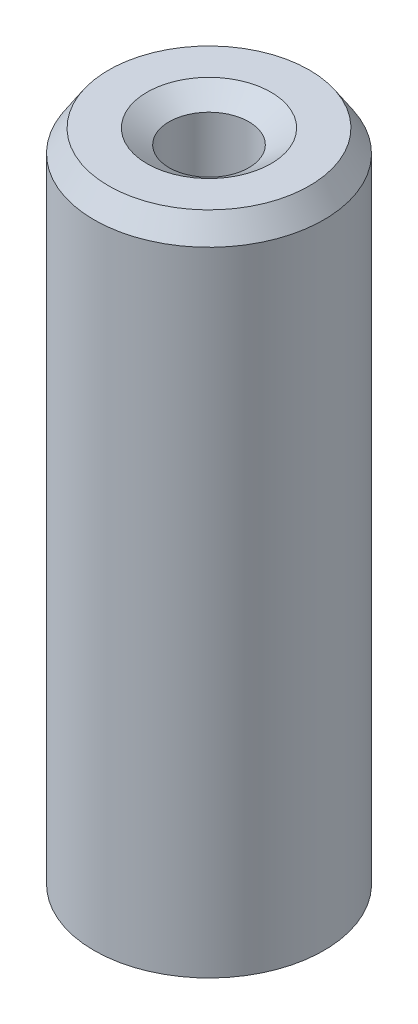
ISO-10303-21;
HEADER;
FILE_DESCRIPTION(('STEP AP214'),'2;1');
FILE_NAME('part.step','',(''),(''),'','','');
FILE_SCHEMA(('AUTOMOTIVE_DESIGN { 1 0 10303 214 1 1 1 1 }'));
ENDSEC;
DATA;
#1=APPLICATION_CONTEXT('core data for automotive mechanical design processes');
#2=APPLICATION_PROTOCOL_DEFINITION('international standard','automotive_design',2000,#1);
#3=PRODUCT_CONTEXT('',#1,'mechanical');
#4=PRODUCT('Part','Part','',(#3));
#5=PRODUCT_RELATED_PRODUCT_CATEGORY('part','',(#4));
#6=PRODUCT_DEFINITION_FORMATION('','',#4);
#7=PRODUCT_DEFINITION_CONTEXT('part definition',#1,'design');
#8=PRODUCT_DEFINITION('design','',#6,#7);
#9=PRODUCT_DEFINITION_SHAPE('','',#8);
#10=(LENGTH_UNIT() NAMED_UNIT(*) SI_UNIT(.MILLI.,.METRE.));
#11=(NAMED_UNIT(*) PLANE_ANGLE_UNIT() SI_UNIT($,.RADIAN.));
#12=(NAMED_UNIT(*) SI_UNIT($,.STERADIAN.) SOLID_ANGLE_UNIT());
#13=UNCERTAINTY_MEASURE_WITH_UNIT(LENGTH_MEASURE(1.E-05),#10,'distance_accuracy_value','');
#14=(GEOMETRIC_REPRESENTATION_CONTEXT(3) GLOBAL_UNCERTAINTY_ASSIGNED_CONTEXT((#13)) GLOBAL_UNIT_ASSIGNED_CONTEXT((#10,
#11,#12)) REPRESENTATION_CONTEXT('',''));
#15=CARTESIAN_POINT('',(0.,0.,0.));
#16=DIRECTION('',(0.,0.,1.));
#17=DIRECTION('',(1.,0.,0.));
#18=AXIS2_PLACEMENT_3D('',#15,#16,#17);
#19=CARTESIAN_POINT('',(0.,87.3805619290732,0.));
#20=DIRECTION('',(0.,-1.,0.));
#21=DIRECTION('',(0.,0.,-1.));
#22=AXIS2_PLACEMENT_3D('',#19,#20,#21);
#23=CYLINDRICAL_SURFACE('',#22,15.);
#24=CARTESIAN_POINT('',(0.,1.89704975625297,0.));
#25=DIRECTION('',(0.,1.,0.));
#26=DIRECTION('',(0.,0.,1.));
#27=AXIS2_PLACEMENT_3D('',#24,#25,#26);
#28=CIRCLE('',#27,15.);
#29=CARTESIAN_POINT('',(0.,1.89704975625297,15.));
#30=VERTEX_POINT('',#29);
#31=EDGE_CURVE('E10',#30,#30,#28,.T.);
#32=ORIENTED_EDGE('',*,*,#31,.T.);
#33=EDGE_LOOP('',(#32));
#34=FACE_BOUND('',#33,.T.);
#35=CARTESIAN_POINT('',(0.,84.4921304916839,0.));
#36=DIRECTION('',(0.,1.,0.));
#37=DIRECTION('',(0.,0.,1.));
#38=AXIS2_PLACEMENT_3D('',#35,#36,#37);
#39=CIRCLE('',#38,15.);
#40=CARTESIAN_POINT('',(0.,84.4921304916839,15.));
#41=VERTEX_POINT('',#40);
#42=EDGE_CURVE('E50',#41,#41,#39,.F.);
#43=ORIENTED_EDGE('',*,*,#42,.T.);
#44=EDGE_LOOP('',(#43));
#45=FACE_BOUND('',#44,.T.);
#46=ADVANCED_FACE('F39',(#34,#45),#23,.T.);
#47=CARTESIAN_POINT('',(0.,87.3805619290732,0.));
#48=DIRECTION('',(0.,1.,0.));
#49=DIRECTION('',(0.,0.,1.));
#50=AXIS2_PLACEMENT_3D('',#47,#48,#49);
#51=PLANE('',#50);
#52=CARTESIAN_POINT('',(0.,87.3805619290732,0.));
#53=DIRECTION('',(0.,1.,0.));
#54=DIRECTION('',(0.,0.,1.));
#55=AXIS2_PLACEMENT_3D('',#52,#53,#54);
#56=CIRCLE('',#55,8.09088606203556);
#57=CARTESIAN_POINT('',(0.,87.3805619290732,8.09088606203556));
#58=VERTEX_POINT('',#57);
#59=EDGE_CURVE('E58',#58,#58,#56,.F.);
#60=ORIENTED_EDGE('',*,*,#59,.T.);
#61=EDGE_LOOP('',(#60));
#62=FACE_BOUND('',#61,.T.);
#63=CARTESIAN_POINT('',(0.,87.3805619290732,0.));
#64=DIRECTION('',(0.,1.,0.));
#65=DIRECTION('',(0.,0.,1.));
#66=AXIS2_PLACEMENT_3D('',#63,#64,#65);
#67=CIRCLE('',#66,13.102950243747);
#68=CARTESIAN_POINT('',(0.,87.3805619290732,13.102950243747));
#69=VERTEX_POINT('',#68);
#70=EDGE_CURVE('E61',#69,#69,#67,.T.);
#71=ORIENTED_EDGE('',*,*,#70,.T.);
#72=EDGE_LOOP('',(#71));
#73=FACE_BOUND('',#72,.T.);
#74=ADVANCED_FACE('F88',(#62,#73),#51,.T.);
#75=CARTESIAN_POINT('',(0.,0.,0.));
#76=DIRECTION('',(0.,1.,0.));
#77=DIRECTION('',(0.,0.,1.));
#78=AXIS2_PLACEMENT_3D('',#75,#76,#77);
#79=PLANE('',#78);
#80=CARTESIAN_POINT('',(0.,0.,0.));
#81=DIRECTION('',(0.,1.,0.));
#82=DIRECTION('',(0.,0.,1.));
#83=AXIS2_PLACEMENT_3D('',#80,#81,#82);
#84=CIRCLE('',#83,7.09950438089922);
#85=CARTESIAN_POINT('',(0.,0.,7.09950438089922));
#86=VERTEX_POINT('',#85);
#87=EDGE_CURVE('E51',#86,#86,#84,.T.);
#88=ORIENTED_EDGE('',*,*,#87,.T.);
#89=EDGE_LOOP('',(#88));
#90=FACE_BOUND('',#89,.T.);
#91=CARTESIAN_POINT('',(0.,0.,0.));
#92=DIRECTION('',(0.,1.,0.));
#93=DIRECTION('',(0.,0.,1.));
#94=AXIS2_PLACEMENT_3D('',#91,#92,#93);
#95=CIRCLE('',#94,12.1115685626107);
#96=CARTESIAN_POINT('',(0.,0.,12.1115685626107));
#97=VERTEX_POINT('',#96);
#98=EDGE_CURVE('E54',#97,#97,#95,.F.);
#99=ORIENTED_EDGE('',*,*,#98,.T.);
#100=EDGE_LOOP('',(#99));
#101=FACE_BOUND('',#100,.T.);
#102=ADVANCED_FACE('F83',(#90,#101),#79,.F.);
#103=CARTESIAN_POINT('',(0.,87.3805619290732,0.));
#104=DIRECTION('',(0.,-1.,0.));
#105=DIRECTION('',(0.,0.,-1.));
#106=AXIS2_PLACEMENT_3D('',#103,#104,#105);
#107=CYLINDRICAL_SURFACE('',#106,5.20245462464623);
#108=CARTESIAN_POINT('',(0.,85.4835121728201,0.));
#109=DIRECTION('',(0.,1.,0.));
#110=DIRECTION('',(0.,0.,1.));
#111=AXIS2_PLACEMENT_3D('',#108,#109,#110);
#112=CIRCLE('',#111,5.20245462464623);
#113=CARTESIAN_POINT('',(0.,85.4835121728201,5.20245462464623));
#114=VERTEX_POINT('',#113);
#115=EDGE_CURVE('E67',#114,#114,#112,.T.);
#116=ORIENTED_EDGE('',*,*,#115,.T.);
#117=EDGE_LOOP('',(#116));
#118=FACE_BOUND('',#117,.T.);
#119=CARTESIAN_POINT('',(0.,2.88843143738929,0.));
#120=DIRECTION('',(0.,1.,0.));
#121=DIRECTION('',(0.,0.,1.));
#122=AXIS2_PLACEMENT_3D('',#119,#120,#121);
#123=CIRCLE('',#122,5.20245462464623);
#124=CARTESIAN_POINT('',(0.,2.88843143738929,5.20245462464623));
#125=VERTEX_POINT('',#124);
#126=EDGE_CURVE('E69',#125,#125,#123,.F.);
#127=ORIENTED_EDGE('',*,*,#126,.T.);
#128=EDGE_LOOP('',(#127));
#129=FACE_BOUND('',#128,.T.);
#130=ADVANCED_FACE('F71',(#118,#129),#107,.F.);
#131=CARTESIAN_POINT('',(0.,85.4835121728201,0.));
#132=DIRECTION('',(0.,1.,0.));
#133=DIRECTION('',(0.,0.,1.));
#134=AXIS2_PLACEMENT_3D('',#131,#132,#133);
#135=CONICAL_SURFACE('',#134,5.20245462464623,0.989673051012792);
#136=ORIENTED_EDGE('',*,*,#59,.F.);
#137=EDGE_LOOP('',(#136));
#138=FACE_BOUND('',#137,.T.);
#139=ORIENTED_EDGE('',*,*,#115,.F.);
#140=EDGE_LOOP('',(#139));
#141=FACE_BOUND('',#140,.T.);
#142=ADVANCED_FACE('F77',(#138,#141),#135,.F.);
#143=CARTESIAN_POINT('',(0.,0.,0.));
#144=DIRECTION('',(0.,-1.,0.));
#145=DIRECTION('',(0.,0.,-1.));
#146=AXIS2_PLACEMENT_3D('',#143,#144,#145);
#147=CONICAL_SURFACE('',#146,7.09950438089922,0.581123275782106);
#148=ORIENTED_EDGE('',*,*,#126,.F.);
#149=EDGE_LOOP('',(#148));
#150=FACE_BOUND('',#149,.T.);
#151=ORIENTED_EDGE('',*,*,#87,.F.);
#152=EDGE_LOOP('',(#151));
#153=FACE_BOUND('',#152,.T.);
#154=ADVANCED_FACE('F73',(#150,#153),#147,.F.);
#155=CARTESIAN_POINT('',(0.,1.89704975625297,0.));
#156=DIRECTION('',(0.,1.,0.));
#157=DIRECTION('',(0.,0.,1.));
#158=AXIS2_PLACEMENT_3D('',#155,#156,#157);
#159=CONICAL_SURFACE('',#158,15.,0.989673051012794);
#160=CARTESIAN_POINT('',(0.,0.,12.1115685626107));
#161=CARTESIAN_POINT('',(0.,0.0197609349609687,12.1416563900835));
#162=CARTESIAN_POINT('',(0.,0.039521869921937,12.1717442175563));
#163=CARTESIAN_POINT('',(0.,0.0790437398438737,12.2319198725019));
#164=CARTESIAN_POINT('',(0.,0.098804674804842,12.2620076999747));
#165=CARTESIAN_POINT('',(0.,0.138326544726779,12.3221833549203));
#166=CARTESIAN_POINT('',(0.,0.158087479687748,12.3522711823932));
#167=CARTESIAN_POINT('',(0.,0.197609349609685,12.4124468373388));
#168=CARTESIAN_POINT('',(0.,0.217370284570653,12.4425346648116));
#169=CARTESIAN_POINT('',(0.,0.25689215449259,12.5027103197572));
#170=CARTESIAN_POINT('',(0.,0.276653089453559,12.53279814723));
#171=CARTESIAN_POINT('',(0.,0.316174959375496,12.5929738021756));
#172=CARTESIAN_POINT('',(0.,0.335935894336464,12.6230616296484));
#173=CARTESIAN_POINT('',(0.,0.375457764258401,12.683237284594));
#174=CARTESIAN_POINT('',(0.,0.395218699219369,12.7133251120668));
#175=CARTESIAN_POINT('',(0.,0.434740569141307,12.7735007670124));
#176=CARTESIAN_POINT('',(0.,0.454501504102275,12.8035885944852));
#177=CARTESIAN_POINT('',(0.,0.494023374024212,12.8637642494308));
#178=CARTESIAN_POINT('',(0.,0.513784308985181,12.8938520769036));
#179=CARTESIAN_POINT('',(0.,0.553306178907117,12.9540277318493));
#180=CARTESIAN_POINT('',(0.,0.573067113868086,12.9841155593221));
#181=CARTESIAN_POINT('',(0.,0.612588983790023,13.0442912142677));
#182=CARTESIAN_POINT('',(0.,0.632349918750991,13.0743790417405));
#183=CARTESIAN_POINT('',(0.,0.671871788672929,13.1345546966861));
#184=CARTESIAN_POINT('',(0.,0.691632723633897,13.1646425241589));
#185=CARTESIAN_POINT('',(0.,0.731154593555834,13.2248181791045));
#186=CARTESIAN_POINT('',(0.,0.750915528516802,13.2549060065773));
#187=CARTESIAN_POINT('',(0.,0.790437398438739,13.3150816615229));
#188=CARTESIAN_POINT('',(0.,0.810198333399708,13.3451694889957));
#189=CARTESIAN_POINT('',(0.,0.849720203321645,13.4053451439413));
#190=CARTESIAN_POINT('',(0.,0.869481138282613,13.4354329714141));
#191=CARTESIAN_POINT('',(0.,0.90900300820455,13.4956086263597));
#192=CARTESIAN_POINT('',(0.,0.928763943165519,13.5256964538326));
#193=CARTESIAN_POINT('',(0.,0.968285813087456,13.5858721087782));
#194=CARTESIAN_POINT('',(0.,0.988046748048424,13.615959936251));
#195=CARTESIAN_POINT('',(0.,1.02756861797036,13.6761355911966));
#196=CARTESIAN_POINT('',(0.,1.04732955293133,13.7062234186694));
#197=CARTESIAN_POINT('',(0.,1.08685142285327,13.766399073615));
#198=CARTESIAN_POINT('',(0.,1.10661235781424,13.7964869010878));
#199=CARTESIAN_POINT('',(0.,1.14613422773617,13.8566625560334));
#200=CARTESIAN_POINT('',(0.,1.16589516269714,13.8867503835062));
#201=CARTESIAN_POINT('',(0.,1.20541703261908,13.9469260384518));
#202=CARTESIAN_POINT('',(0.,1.22517796758005,13.9770138659246));
#203=CARTESIAN_POINT('',(0.,1.26469983750198,14.0371895208702));
#204=CARTESIAN_POINT('',(0.,1.28446077246295,14.067277348343));
#205=CARTESIAN_POINT('',(0.,1.32398264238489,14.1274530032887));
#206=CARTESIAN_POINT('',(0.,1.34374357734586,14.1575408307615));
#207=CARTESIAN_POINT('',(0.,1.38326544726779,14.2177164857071));
#208=CARTESIAN_POINT('',(0.,1.40302638222876,14.2478043131799));
#209=CARTESIAN_POINT('',(0.,1.4425482521507,14.3079799681255));
#210=CARTESIAN_POINT('',(0.,1.46230918711167,14.3380677955983));
#211=CARTESIAN_POINT('',(0.,1.5018310570336,14.3982434505439));
#212=CARTESIAN_POINT('',(0.,1.52159199199457,14.4283312780167));
#213=CARTESIAN_POINT('',(0.,1.56111386191651,14.4885069329623));
#214=CARTESIAN_POINT('',(0.,1.58087479687748,14.5185947604351));
#215=CARTESIAN_POINT('',(0.,1.62039666679942,14.5787704153807));
#216=CARTESIAN_POINT('',(0.,1.64015760176038,14.6088582428535));
#217=CARTESIAN_POINT('',(0.,1.67967947168232,14.6690338977991));
#218=CARTESIAN_POINT('',(0.,1.69944040664329,14.6991217252719));
#219=CARTESIAN_POINT('',(0.,1.73896227656523,14.7592973802176));
#220=CARTESIAN_POINT('',(0.,1.7587232115262,14.7893852076904));
#221=CARTESIAN_POINT('',(0.,1.79824508144813,14.849560862636));
#222=CARTESIAN_POINT('',(0.,1.8180060164091,14.8796486901088));
#223=CARTESIAN_POINT('',(0.,1.85752788633104,14.9398243450544));
#224=CARTESIAN_POINT('',(0.,1.87728882129201,14.9699121725272));
#225=CARTESIAN_POINT('',(0.,1.89704975625297,15.));
#226=B_SPLINE_CURVE_WITH_KNOTS('',3,(#160,#161,#162,#163,#164,#165,#166,#167,#168,#169,#170,
#171,#172,#173,#174,#175,#176,#177,#178,#179,#180,#181,#182,#183,#184,#185,#186,#187,#188,#189,
#190,#191,#192,#193,#194,#195,#196,#197,#198,#199,#200,#201,#202,#203,#204,#205,#206,#207,#208,
#209,#210,#211,#212,#213,#214,#215,#216,#217,#218,#219,#220,#221,#222,#223,#224,#225),
.UNSPECIFIED.,.F.,.F.,(4,2,2,2,2,2,2,2,2,2,2,2,2,2,2,2,2,2,2,2,2,2,2,2,2,2,2,2,2,2,2,2,4),(0.,
0.107990495938689,0.21598099187738,0.323971487816069,0.43196198375476,0.539952479693449,
0.647942975632139,0.755933471570829,0.863923967509518,0.971914463448208,1.0799049593869,
1.18789545532559,1.29588595126428,1.40387644720297,1.51186694314166,1.61985743908035,
1.72784793501904,1.83583843095773,1.94382892689642,2.05181942283511,2.1598099187738,
2.26780041471249,2.37579091065118,2.48378140658987,2.59177190252856,2.69976239846725,
2.80775289440594,2.91574339034463,3.02373388628332,3.13172438222201,3.2397148781607,
3.34770537409939,3.45569587003808),.UNSPECIFIED.);
#227=EDGE_CURVE('BSEAM76',#97,#30,#226,.T.);
#228=ORIENTED_EDGE('',*,*,#98,.F.);
#229=ORIENTED_EDGE('',*,*,#31,.F.);
#230=ORIENTED_EDGE('',*,*,#227,.T.);
#231=ORIENTED_EDGE('',*,*,#227,.F.);
#232=EDGE_LOOP('',(#228,#230,#229,#231));
#233=FACE_BOUND('',#232,.T.);
#234=ADVANCED_FACE('F76',(#233),#159,.T.);
#235=CARTESIAN_POINT('',(0.,87.3805619290732,0.));
#236=DIRECTION('',(0.,-1.,0.));
#237=DIRECTION('',(0.,0.,-1.));
#238=AXIS2_PLACEMENT_3D('',#235,#236,#237);
#239=CONICAL_SURFACE('',#238,13.102950243747,0.581123275782108);
#240=ORIENTED_EDGE('',*,*,#42,.F.);
#241=EDGE_LOOP('',(#240));
#242=FACE_BOUND('',#241,.T.);
#243=ORIENTED_EDGE('',*,*,#70,.F.);
#244=EDGE_LOOP('',(#243));
#245=FACE_BOUND('',#244,.T.);
#246=ADVANCED_FACE('F45',(#242,#245),#239,.T.);
#247=CLOSED_SHELL('',(#46,#74,#102,#130,#142,#154,#234,#246));
#248=MANIFOLD_SOLID_BREP('B2',#247);
#249=ADVANCED_BREP_SHAPE_REPRESENTATION('',(#18,#248),#14);
#250=SHAPE_DEFINITION_REPRESENTATION(#9,#249);
ENDSEC;
END-ISO-10303-21;
